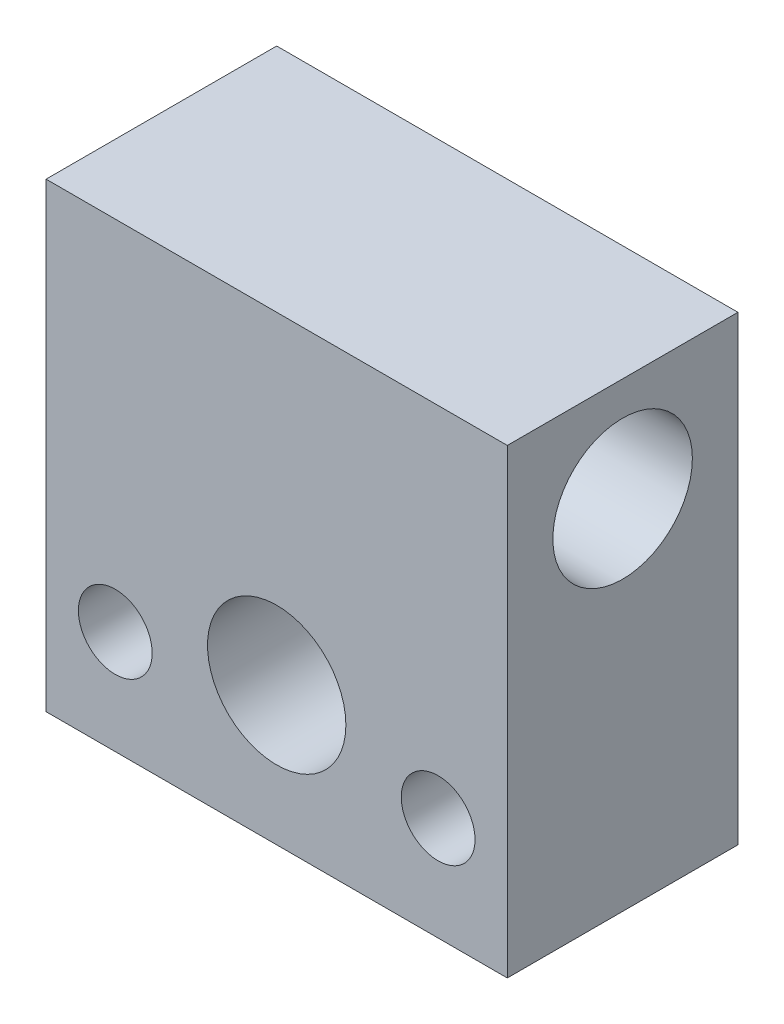
ISO-10303-21;
HEADER;
FILE_DESCRIPTION(('STEP AP214'),'2;1');
FILE_NAME('part.step','',(''),(''),'','','');
FILE_SCHEMA(('AUTOMOTIVE_DESIGN { 1 0 10303 214 1 1 1 1 }'));
ENDSEC;
DATA;
#1=APPLICATION_CONTEXT('core data for automotive mechanical design processes');
#2=APPLICATION_PROTOCOL_DEFINITION('international standard','automotive_design',2000,#1);
#3=PRODUCT_CONTEXT('',#1,'mechanical');
#4=PRODUCT('Part','Part','',(#3));
#5=PRODUCT_RELATED_PRODUCT_CATEGORY('part','',(#4));
#6=PRODUCT_DEFINITION_FORMATION('','',#4);
#7=PRODUCT_DEFINITION_CONTEXT('part definition',#1,'design');
#8=PRODUCT_DEFINITION('design','',#6,#7);
#9=PRODUCT_DEFINITION_SHAPE('','',#8);
#10=(LENGTH_UNIT() NAMED_UNIT(*) SI_UNIT(.MILLI.,.METRE.));
#11=(NAMED_UNIT(*) PLANE_ANGLE_UNIT() SI_UNIT($,.RADIAN.));
#12=(NAMED_UNIT(*) SI_UNIT($,.STERADIAN.) SOLID_ANGLE_UNIT());
#13=UNCERTAINTY_MEASURE_WITH_UNIT(LENGTH_MEASURE(1.E-05),#10,'distance_accuracy_value','');
#14=(GEOMETRIC_REPRESENTATION_CONTEXT(3) GLOBAL_UNCERTAINTY_ASSIGNED_CONTEXT((#13)) GLOBAL_UNIT_ASSIGNED_CONTEXT((#10,
#11,#12)) REPRESENTATION_CONTEXT('',''));
#15=CARTESIAN_POINT('',(0.,0.,0.));
#16=DIRECTION('',(0.,0.,1.));
#17=DIRECTION('',(1.,0.,0.));
#18=AXIS2_PLACEMENT_3D('',#15,#16,#17);
#19=CARTESIAN_POINT('',(-5.,0.,10.));
#20=DIRECTION('',(-1.,0.,0.));
#21=DIRECTION('',(0.,0.,1.));
#22=AXIS2_PLACEMENT_3D('',#19,#20,#21);
#23=PLANE('',#22);
#24=CARTESIAN_POINT('',(-5.,-1.5,2.));
#25=DIRECTION('',(-1.,0.,0.));
#26=DIRECTION('',(0.,0.,1.));
#27=AXIS2_PLACEMENT_3D('',#24,#25,#26);
#28=CIRCLE('',#27,1.);
#29=CARTESIAN_POINT('',(-5.,-1.5,3.));
#30=VERTEX_POINT('',#29);
#31=EDGE_CURVE('E20',#30,#30,#28,.T.);
#32=ORIENTED_EDGE('',*,*,#31,.T.);
#33=EDGE_LOOP('',(#32));
#34=FACE_BOUND('',#33,.T.);
#35=ADVANCED_FACE('F17',(#34),#23,.T.);
#36=CARTESIAN_POINT('',(-6.,0.,0.));
#37=DIRECTION('',(-1.,0.,0.));
#38=DIRECTION('',(0.,0.,1.));
#39=AXIS2_PLACEMENT_3D('',#36,#37,#38);
#40=PLANE('',#39);
#41=CARTESIAN_POINT('',(-6.,-1.5,5.5));
#42=DIRECTION('',(-1.,0.,0.));
#43=DIRECTION('',(0.,0.,1.));
#44=AXIS2_PLACEMENT_3D('',#41,#42,#43);
#45=CIRCLE('',#44,1.5);
#46=CARTESIAN_POINT('',(-6.,-1.5,7.));
#47=VERTEX_POINT('',#46);
#48=EDGE_CURVE('E130',#47,#47,#45,.T.);
#49=ORIENTED_EDGE('',*,*,#48,.T.);
#50=EDGE_LOOP('',(#49));
#51=FACE_BOUND('',#50,.T.);
#52=ADVANCED_FACE('F159',(#51),#40,.T.);
#53=CARTESIAN_POINT('',(0.,5.5,0.));
#54=DIRECTION('',(0.,0.,-1.));
#55=DIRECTION('',(-1.,0.,0.));
#56=AXIS2_PLACEMENT_3D('',#53,#54,#55);
#57=CYLINDRICAL_SURFACE('',#56,1.5);
#58=CARTESIAN_POINT('',(1.5,5.5,1.975));
#59=CARTESIAN_POINT('',(1.49999594047018,5.57900144630801,1.97500356043906));
#60=CARTESIAN_POINT('',(1.49372693576098,5.65804837745387,1.97812566666901));
#61=CARTESIAN_POINT('',(1.46893959830404,5.81376412220572,1.99029966306556));
#62=CARTESIAN_POINT('',(1.45040864995801,5.89043040135985,1.99935766023134));
#63=CARTESIAN_POINT('',(1.40199846961452,6.03896385695773,2.02245479182461));
#64=CARTESIAN_POINT('',(1.37215905632387,6.11084684381869,2.03647643725468));
#65=CARTESIAN_POINT('',(1.30219691790721,6.24849863267949,2.06821357281648));
#66=CARTESIAN_POINT('',(1.26207301806937,6.31426673505646,2.08592948487061));
#67=CARTESIAN_POINT('',(1.16995731065494,6.44222108280155,2.12466073278959));
#68=CARTESIAN_POINT('',(1.11739997976672,6.50395906458766,2.14580990556196));
#69=CARTESIAN_POINT('',(1.0031271487249,6.61815419955558,2.18858021506086));
#70=CARTESIAN_POINT('',(0.941405217206993,6.67060477806009,2.21020167405788));
#71=CARTESIAN_POINT('',(0.804926658722086,6.76873167990099,2.25335964948605));
#72=CARTESIAN_POINT('',(0.729536017881986,6.81359067773629,2.27476493273293));
#73=CARTESIAN_POINT('',(0.571103482437755,6.88980291346821,2.31282681627039));
#74=CARTESIAN_POINT('',(0.4880670033303,6.92116562271595,2.32948674394543));
#75=CARTESIAN_POINT('',(0.321740750954993,6.96747419696827,2.35466323851127));
#76=CARTESIAN_POINT('',(0.238759352163179,6.98328499768358,2.36360494965244));
#77=CARTESIAN_POINT('',(0.0708794694097341,7.00069285570871,2.37347037411611));
#78=CARTESIAN_POINT('',(-0.0140171024281057,7.00230351116717,2.3744017581574));
#79=CARTESIAN_POINT('',(-0.172629443740668,6.99190046308059,2.36848430022382));
#80=CARTESIAN_POINT('',(-0.246490058966555,6.98146052673182,2.36253400278224));
#81=CARTESIAN_POINT('',(-0.391230964006536,6.94997459930692,2.34509525123016));
#82=CARTESIAN_POINT('',(-0.46211032721989,6.92892533676304,2.33360508890698));
#83=CARTESIAN_POINT('',(-0.600898386504531,6.87642947527521,2.30612583887848));
#84=CARTESIAN_POINT('',(-0.668699211124015,6.84475178294496,2.29003805345798));
#85=CARTESIAN_POINT('',(-0.798344551502015,6.77207503652154,2.25517346346266));
#86=CARTESIAN_POINT('',(-0.860186510561525,6.73107200644798,2.23639551316821));
#87=CARTESIAN_POINT('',(-0.984256578247225,6.63496133604325,2.19544298686002));
#88=CARTESIAN_POINT('',(-1.04557656112961,6.57873384380673,2.17313639274875));
#89=CARTESIAN_POINT('',(-1.15830345819555,6.45668082223522,2.12953202590372));
#90=CARTESIAN_POINT('',(-1.20970387570264,6.3908490519359,2.10823492116113));
#91=CARTESIAN_POINT('',(-1.30330651599731,6.24768473858028,2.067873118354));
#92=CARTESIAN_POINT('',(-1.34498421172647,6.16996535849951,2.04895396414971));
#93=CARTESIAN_POINT('',(-1.41428907876496,6.00749420403244,2.01673148934985));
#94=CARTESIAN_POINT('',(-1.44194305133928,5.92275620668402,2.00341746491714));
#95=CARTESIAN_POINT('',(-1.47450721867071,5.78107868035783,1.98757839526593));
#96=CARTESIAN_POINT('',(-1.48404343221979,5.7254041139936,1.98288549806455));
#97=CARTESIAN_POINT('',(-1.49679098596232,5.61316075670564,1.97659516756892));
#98=CARTESIAN_POINT('',(-1.50000290801143,5.55659204852868,1.97499744950821));
#99=CARTESIAN_POINT('',(-1.49999594047018,5.42099855369198,1.97500356043906));
#100=CARTESIAN_POINT('',(-1.49372693576097,5.34195162254613,1.97812566666901));
#101=CARTESIAN_POINT('',(-1.46893959830404,5.18623587779428,1.99029966306556));
#102=CARTESIAN_POINT('',(-1.45040864995801,5.10956959864015,1.99935766023134));
#103=CARTESIAN_POINT('',(-1.40199846961452,4.96103614304227,2.02245479182461));
#104=CARTESIAN_POINT('',(-1.37215905632387,4.88915315618131,2.03647643725468));
#105=CARTESIAN_POINT('',(-1.30219691790721,4.75150136732051,2.06821357281648));
#106=CARTESIAN_POINT('',(-1.26207301806937,4.68573326494354,2.08592948487061));
#107=CARTESIAN_POINT('',(-1.16995731065493,4.55777891719845,2.12466073278959));
#108=CARTESIAN_POINT('',(-1.11739997976672,4.49604093541234,2.14580990556196));
#109=CARTESIAN_POINT('',(-1.0031271487249,4.38184580044442,2.18858021506086));
#110=CARTESIAN_POINT('',(-0.941405217206992,4.32939522193991,2.21020167405788));
#111=CARTESIAN_POINT('',(-0.804926658722085,4.23126832009901,2.25335964948605));
#112=CARTESIAN_POINT('',(-0.729536017881984,4.18640932226371,2.27476493273293));
#113=CARTESIAN_POINT('',(-0.571103482437753,4.11019708653179,2.31282681627039));
#114=CARTESIAN_POINT('',(-0.488067003330298,4.07883437728405,2.32948674394543));
#115=CARTESIAN_POINT('',(-0.321740750954991,4.03252580303173,2.35466323851127));
#116=CARTESIAN_POINT('',(-0.238759352163177,4.01671500231642,2.36360494965244));
#117=CARTESIAN_POINT('',(-0.070879469409732,3.99930714429129,2.37347037411611));
#118=CARTESIAN_POINT('',(0.0140171024281078,3.99769648883283,2.3744017581574));
#119=CARTESIAN_POINT('',(0.17262944374067,4.00809953691941,2.36848430022382));
#120=CARTESIAN_POINT('',(0.246490058966557,4.01853947326818,2.36253400278224));
#121=CARTESIAN_POINT('',(0.391230964006538,4.05002540069308,2.34509525123016));
#122=CARTESIAN_POINT('',(0.462110327219892,4.07107466323696,2.33360508890698));
#123=CARTESIAN_POINT('',(0.600898386504532,4.12357052472479,2.30612583887848));
#124=CARTESIAN_POINT('',(0.668699211124016,4.15524821705504,2.29003805345798));
#125=CARTESIAN_POINT('',(0.798344551502016,4.22792496347846,2.25517346346266));
#126=CARTESIAN_POINT('',(0.860186510561526,4.26892799355202,2.23639551316821));
#127=CARTESIAN_POINT('',(0.984256578247227,4.36503866395675,2.19544298686002));
#128=CARTESIAN_POINT('',(1.04557656112961,4.42126615619327,2.17313639274875));
#129=CARTESIAN_POINT('',(1.15830345819555,4.54331917776478,2.12953202590372));
#130=CARTESIAN_POINT('',(1.20970387570264,4.6091509480641,2.10823492116113));
#131=CARTESIAN_POINT('',(1.30330651599732,4.75231526141973,2.067873118354));
#132=CARTESIAN_POINT('',(1.34498421172647,4.83003464150049,2.04895396414971));
#133=CARTESIAN_POINT('',(1.41428907876496,4.99250579596756,2.01673148934985));
#134=CARTESIAN_POINT('',(1.44194305133928,5.07724379331598,2.00341746491714));
#135=CARTESIAN_POINT('',(1.47450721867071,5.21892131964217,1.98757839526593));
#136=CARTESIAN_POINT('',(1.48404343221979,5.2745958860064,1.98288549806455));
#137=CARTESIAN_POINT('',(1.49679098596232,5.38683924329436,1.97659516756892));
#138=CARTESIAN_POINT('',(1.50000290801143,5.44340795147132,1.97499744950821));
#139=CARTESIAN_POINT('',(1.5,5.5,1.975));
#140=B_SPLINE_CURVE_WITH_KNOTS('',3,(#58,#59,#60,#61,#62,#63,#64,#65,#66,#67,#68,#69,#70,#71,
#72,#73,#74,#75,#76,#77,#78,#79,#80,#81,#82,#83,#84,#85,#86,#87,#88,#89,#90,#91,#92,#93,#94,#95,
#96,#97,#98,#99,#100,#101,#102,#103,#104,#105,#106,#107,#108,#109,#110,#111,#112,#113,#114,#115,
#116,#117,#118,#119,#120,#121,#122,#123,#124,#125,#126,#127,#128,#129,#130,#131,#132,#133,#134,
#135,#136,#137,#138,#139),.UNSPECIFIED.,.T.,.F.,(4,2,2,2,2,2,2,2,2,2,2,2,2,2,2,2,2,2,2,2,2,2,2,
2,2,2,2,2,2,2,2,2,2,2,2,2,2,2,2,2,4),(0.,0.236782321681719,0.473808634445435,0.710007983763761,
0.946234324211956,1.1965638581735,1.44706990138711,1.71660637764891,1.98595339038829,
2.23929197683291,2.49238793826836,2.71583794222608,2.93935689091262,3.16809007155546,
3.39692095903474,3.65420522783989,3.91165743363485,4.18081624560758,4.44945870091991,
4.61909141374399,4.78870851907015,5.02549084075187,5.26251715351558,5.49871650283391,
5.7349428432821,5.98527237724365,6.23577842045725,6.50531489671906,6.77466190945843,
7.02800049590306,7.28109645733851,7.50454646129622,7.72806540998277,7.9567985906256,
8.18562947810489,8.44291374691004,8.700365952705,8.96952476467773,9.23816721999005,
9.40779993281413,9.57741703814029),.UNSPECIFIED.);
#141=CARTESIAN_POINT('',(1.5,5.5,1.975));
#142=VERTEX_POINT('',#141);
#143=EDGE_CURVE('E124',#142,#142,#140,.T.);
#144=ORIENTED_EDGE('',*,*,#143,.T.);
#145=EDGE_LOOP('',(#144));
#146=FACE_BOUND('',#145,.T.);
#147=CARTESIAN_POINT('',(0.,5.5,0.));
#148=DIRECTION('',(0.,0.,-1.));
#149=DIRECTION('',(-1.,0.,0.));
#150=AXIS2_PLACEMENT_3D('',#147,#148,#149);
#151=CIRCLE('',#150,1.5);
#152=CARTESIAN_POINT('',(-1.5,5.5,0.));
#153=VERTEX_POINT('',#152);
#154=EDGE_CURVE('E121',#153,#153,#151,.T.);
#155=ORIENTED_EDGE('',*,*,#154,.T.);
#156=EDGE_LOOP('',(#155));
#157=FACE_BOUND('',#156,.T.);
#158=ADVANCED_FACE('F131',(#146,#157),#57,.F.);
#159=CARTESIAN_POINT('',(-7.,-5.5,5.6843418860808E-11));
#160=DIRECTION('',(0.,0.,-1.));
#161=DIRECTION('',(-1.,0.,0.));
#162=AXIS2_PLACEMENT_3D('',#159,#160,#161);
#163=CONICAL_SURFACE('',#162,2.80000000009795,0.785398163397448);
#164=CARTESIAN_POINT('',(-7.,-5.5,1.2));
#165=DIRECTION('',(0.,0.,1.));
#166=DIRECTION('',(1.,0.,0.));
#167=AXIS2_PLACEMENT_3D('',#164,#165,#166);
#168=CIRCLE('',#167,1.6);
#169=CARTESIAN_POINT('',(-5.4,-5.5,1.2));
#170=VERTEX_POINT('',#169);
#171=EDGE_CURVE('E93',#170,#170,#168,.T.);
#172=ORIENTED_EDGE('',*,*,#171,.T.);
#173=EDGE_LOOP('',(#172));
#174=FACE_BOUND('',#173,.T.);
#175=CARTESIAN_POINT('',(-7.,-5.5,5.6843418860808E-11));
#176=DIRECTION('',(0.,0.,-1.));
#177=DIRECTION('',(-1.,0.,0.));
#178=AXIS2_PLACEMENT_3D('',#175,#176,#177);
#179=CIRCLE('',#178,2.80000000009795);
#180=CARTESIAN_POINT('',(-9.80000000009795,-5.5,5.6843418860808E-11));
#181=VERTEX_POINT('',#180);
#182=EDGE_CURVE('E96',#181,#181,#179,.T.);
#183=ORIENTED_EDGE('',*,*,#182,.T.);
#184=EDGE_LOOP('',(#183));
#185=FACE_BOUND('',#184,.T.);
#186=ADVANCED_FACE('F151',(#174,#185),#163,.F.);
#187=CARTESIAN_POINT('',(7.,-5.5,5.6843418860808E-11));
#188=DIRECTION('',(0.,0.,-1.));
#189=DIRECTION('',(-1.,0.,0.));
#190=AXIS2_PLACEMENT_3D('',#187,#188,#189);
#191=CONICAL_SURFACE('',#190,2.80000000008795,0.785398163397448);
#192=CARTESIAN_POINT('',(7.,-5.5,1.2));
#193=DIRECTION('',(0.,0.,1.));
#194=DIRECTION('',(1.,0.,0.));
#195=AXIS2_PLACEMENT_3D('',#192,#193,#194);
#196=CIRCLE('',#195,1.6);
#197=CARTESIAN_POINT('',(8.6,-5.5,1.2));
#198=VERTEX_POINT('',#197);
#199=EDGE_CURVE('E90',#198,#198,#196,.T.);
#200=ORIENTED_EDGE('',*,*,#199,.T.);
#201=EDGE_LOOP('',(#200));
#202=FACE_BOUND('',#201,.T.);
#203=CARTESIAN_POINT('',(7.,-5.5,5.6843418860808E-11));
#204=DIRECTION('',(0.,0.,-1.));
#205=DIRECTION('',(-1.,0.,0.));
#206=AXIS2_PLACEMENT_3D('',#203,#204,#205);
#207=CIRCLE('',#206,2.80000000008795);
#208=CARTESIAN_POINT('',(4.19999999991205,-5.5,5.6843418860808E-11));
#209=VERTEX_POINT('',#208);
#210=EDGE_CURVE('E118',#209,#209,#207,.T.);
#211=ORIENTED_EDGE('',*,*,#210,.T.);
#212=EDGE_LOOP('',(#211));
#213=FACE_BOUND('',#212,.T.);
#214=ADVANCED_FACE('F148',(#202,#213),#191,.F.);
#215=CARTESIAN_POINT('',(-10.,-1.5,2.));
#216=DIRECTION('',(-1.,0.,0.));
#217=DIRECTION('',(0.,0.,1.));
#218=AXIS2_PLACEMENT_3D('',#215,#216,#217);
#219=CYLINDRICAL_SURFACE('',#218,1.);
#220=ORIENTED_EDGE('',*,*,#31,.F.);
#221=EDGE_LOOP('',(#220));
#222=FACE_BOUND('',#221,.T.);
#223=CARTESIAN_POINT('',(-10.,-1.5,2.));
#224=DIRECTION('',(-1.,0.,0.));
#225=DIRECTION('',(0.,0.,1.));
#226=AXIS2_PLACEMENT_3D('',#223,#224,#225);
#227=CIRCLE('',#226,1.);
#228=CARTESIAN_POINT('',(-10.,-1.5,3.));
#229=VERTEX_POINT('',#228);
#230=EDGE_CURVE('E69',#229,#229,#227,.F.);
#231=ORIENTED_EDGE('',*,*,#230,.F.);
#232=EDGE_LOOP('',(#231));
#233=FACE_BOUND('',#232,.T.);
#234=ADVANCED_FACE('F144',(#222,#233),#219,.F.);
#235=CARTESIAN_POINT('',(-10.,-1.5,5.5));
#236=DIRECTION('',(-1.,0.,0.));
#237=DIRECTION('',(0.,0.,1.));
#238=AXIS2_PLACEMENT_3D('',#235,#236,#237);
#239=CYLINDRICAL_SURFACE('',#238,1.5);
#240=ORIENTED_EDGE('',*,*,#48,.F.);
#241=EDGE_LOOP('',(#240));
#242=FACE_BOUND('',#241,.T.);
#243=CARTESIAN_POINT('',(-10.,-1.5,5.5));
#244=DIRECTION('',(-1.,0.,0.));
#245=DIRECTION('',(0.,0.,1.));
#246=AXIS2_PLACEMENT_3D('',#243,#244,#245);
#247=CIRCLE('',#246,1.5);
#248=CARTESIAN_POINT('',(-10.,-1.5,7.));
#249=VERTEX_POINT('',#248);
#250=EDGE_CURVE('E86',#249,#249,#247,.F.);
#251=ORIENTED_EDGE('',*,*,#250,.F.);
#252=EDGE_LOOP('',(#251));
#253=FACE_BOUND('',#252,.T.);
#254=ADVANCED_FACE('F139',(#242,#253),#239,.F.);
#255=CARTESIAN_POINT('',(10.,5.5,5.));
#256=DIRECTION('',(1.,0.,0.));
#257=DIRECTION('',(0.,0.,-1.));
#258=AXIS2_PLACEMENT_3D('',#255,#256,#257);
#259=CYLINDRICAL_SURFACE('',#258,3.025);
#260=ORIENTED_EDGE('',*,*,#143,.F.);
#261=EDGE_LOOP('',(#260));
#262=FACE_BOUND('',#261,.T.);
#263=CARTESIAN_POINT('',(-10.,5.5,5.));
#264=DIRECTION('',(1.,0.,0.));
#265=DIRECTION('',(0.,0.,-1.));
#266=AXIS2_PLACEMENT_3D('',#263,#264,#265);
#267=CIRCLE('',#266,3.025);
#268=CARTESIAN_POINT('',(-10.,5.5,1.975));
#269=VERTEX_POINT('',#268);
#270=EDGE_CURVE('E83',#269,#269,#267,.T.);
#271=ORIENTED_EDGE('',*,*,#270,.F.);
#272=EDGE_LOOP('',(#271));
#273=FACE_BOUND('',#272,.T.);
#274=CARTESIAN_POINT('',(10.,5.5,5.));
#275=DIRECTION('',(1.,0.,0.));
#276=DIRECTION('',(0.,0.,-1.));
#277=AXIS2_PLACEMENT_3D('',#274,#275,#276);
#278=CIRCLE('',#277,3.025);
#279=CARTESIAN_POINT('',(10.,5.5,1.975));
#280=VERTEX_POINT('',#279);
#281=EDGE_CURVE('E107',#280,#280,#278,.F.);
#282=ORIENTED_EDGE('',*,*,#281,.F.);
#283=EDGE_LOOP('',(#282));
#284=FACE_BOUND('',#283,.T.);
#285=ADVANCED_FACE('F134',(#262,#273,#284),#259,.F.);
#286=CARTESIAN_POINT('',(0.,0.,0.));
#287=DIRECTION('',(0.,0.,1.));
#288=DIRECTION('',(1.,0.,0.));
#289=AXIS2_PLACEMENT_3D('',#286,#287,#288);
#290=PLANE('',#289);
#291=DIRECTION('',(1.,0.,0.));
#292=VECTOR('',#291,1.);
#293=CARTESIAN_POINT('',(-10.,-10.,0.));
#294=LINE('',#293,#292);
#295=CARTESIAN_POINT('',(-10.,-10.,0.));
#296=VERTEX_POINT('',#295);
#297=CARTESIAN_POINT('',(10.,-10.,0.));
#298=VERTEX_POINT('',#297);
#299=EDGE_CURVE('E74',#296,#298,#294,.T.);
#300=ORIENTED_EDGE('',*,*,#299,.F.);
#301=DIRECTION('',(0.,1.,0.));
#302=VECTOR('',#301,1.);
#303=CARTESIAN_POINT('',(-10.,10.,0.));
#304=LINE('',#303,#302);
#305=CARTESIAN_POINT('',(-10.,10.,0.));
#306=VERTEX_POINT('',#305);
#307=EDGE_CURVE('E55',#306,#296,#304,.F.);
#308=ORIENTED_EDGE('',*,*,#307,.F.);
#309=DIRECTION('',(1.,0.,0.));
#310=VECTOR('',#309,1.);
#311=CARTESIAN_POINT('',(10.,10.,0.));
#312=LINE('',#311,#310);
#313=CARTESIAN_POINT('',(10.,10.,0.));
#314=VERTEX_POINT('',#313);
#315=EDGE_CURVE('E60',#314,#306,#312,.F.);
#316=ORIENTED_EDGE('',*,*,#315,.F.);
#317=DIRECTION('',(0.,1.,0.));
#318=VECTOR('',#317,1.);
#319=CARTESIAN_POINT('',(10.,-10.,0.));
#320=LINE('',#319,#318);
#321=EDGE_CURVE('E339',#298,#314,#320,.T.);
#322=ORIENTED_EDGE('',*,*,#321,.F.);
#323=EDGE_LOOP('',(#300,#308,#316,#322));
#324=FACE_BOUND('',#323,.T.);
#325=CARTESIAN_POINT('',(0.,-4.,0.));
#326=DIRECTION('',(0.,0.,1.));
#327=DIRECTION('',(1.,0.,0.));
#328=AXIS2_PLACEMENT_3D('',#325,#326,#327);
#329=CIRCLE('',#328,3.);
#330=CARTESIAN_POINT('',(3.,-4.,0.));
#331=VERTEX_POINT('',#330);
#332=EDGE_CURVE('E70',#331,#331,#329,.T.);
#333=ORIENTED_EDGE('',*,*,#332,.T.);
#334=EDGE_LOOP('',(#333));
#335=FACE_BOUND('',#334,.T.);
#336=ORIENTED_EDGE('',*,*,#182,.F.);
#337=EDGE_LOOP('',(#336));
#338=FACE_BOUND('',#337,.T.);
#339=ORIENTED_EDGE('',*,*,#210,.F.);
#340=EDGE_LOOP('',(#339));
#341=FACE_BOUND('',#340,.T.);
#342=ORIENTED_EDGE('',*,*,#154,.F.);
#343=EDGE_LOOP('',(#342));
#344=FACE_BOUND('',#343,.T.);
#345=ADVANCED_FACE('F72',(#324,#335,#338,#341,#344),#290,.F.);
#346=CARTESIAN_POINT('',(-7.,-5.5,10.));
#347=DIRECTION('',(0.,0.,1.));
#348=DIRECTION('',(1.,0.,0.));
#349=AXIS2_PLACEMENT_3D('',#346,#347,#348);
#350=CYLINDRICAL_SURFACE('',#349,1.6);
#351=ORIENTED_EDGE('',*,*,#171,.F.);
#352=EDGE_LOOP('',(#351));
#353=FACE_BOUND('',#352,.T.);
#354=CARTESIAN_POINT('',(-7.,-5.5,10.));
#355=DIRECTION('',(0.,0.,1.));
#356=DIRECTION('',(1.,0.,0.));
#357=AXIS2_PLACEMENT_3D('',#354,#355,#356);
#358=CIRCLE('',#357,1.6);
#359=CARTESIAN_POINT('',(-5.4,-5.5,10.));
#360=VERTEX_POINT('',#359);
#361=EDGE_CURVE('E104',#360,#360,#358,.F.);
#362=ORIENTED_EDGE('',*,*,#361,.F.);
#363=EDGE_LOOP('',(#362));
#364=FACE_BOUND('',#363,.T.);
#365=ADVANCED_FACE('F188',(#353,#364),#350,.F.);
#366=CARTESIAN_POINT('',(7.,-5.5,10.));
#367=DIRECTION('',(0.,0.,1.));
#368=DIRECTION('',(1.,0.,0.));
#369=AXIS2_PLACEMENT_3D('',#366,#367,#368);
#370=CYLINDRICAL_SURFACE('',#369,1.6);
#371=ORIENTED_EDGE('',*,*,#199,.F.);
#372=EDGE_LOOP('',(#371));
#373=FACE_BOUND('',#372,.T.);
#374=CARTESIAN_POINT('',(7.,-5.5,10.));
#375=DIRECTION('',(0.,0.,1.));
#376=DIRECTION('',(1.,0.,0.));
#377=AXIS2_PLACEMENT_3D('',#374,#375,#376);
#378=CIRCLE('',#377,1.6);
#379=CARTESIAN_POINT('',(8.6,-5.5,10.));
#380=VERTEX_POINT('',#379);
#381=EDGE_CURVE('E101',#380,#380,#378,.F.);
#382=ORIENTED_EDGE('',*,*,#381,.F.);
#383=EDGE_LOOP('',(#382));
#384=FACE_BOUND('',#383,.T.);
#385=ADVANCED_FACE('F185',(#373,#384),#370,.F.);
#386=CARTESIAN_POINT('',(0.,-4.,10.));
#387=DIRECTION('',(0.,0.,1.));
#388=DIRECTION('',(1.,0.,0.));
#389=AXIS2_PLACEMENT_3D('',#386,#387,#388);
#390=CYLINDRICAL_SURFACE('',#389,3.);
#391=ORIENTED_EDGE('',*,*,#332,.F.);
#392=EDGE_LOOP('',(#391));
#393=FACE_BOUND('',#392,.T.);
#394=CARTESIAN_POINT('',(0.,-4.,10.));
#395=DIRECTION('',(0.,0.,1.));
#396=DIRECTION('',(1.,0.,0.));
#397=AXIS2_PLACEMENT_3D('',#394,#395,#396);
#398=CIRCLE('',#397,3.);
#399=CARTESIAN_POINT('',(3.,-4.,10.));
#400=VERTEX_POINT('',#399);
#401=EDGE_CURVE('E97',#400,#400,#398,.F.);
#402=ORIENTED_EDGE('',*,*,#401,.F.);
#403=EDGE_LOOP('',(#402));
#404=FACE_BOUND('',#403,.T.);
#405=ADVANCED_FACE('F182',(#393,#404),#390,.F.);
#406=CARTESIAN_POINT('',(10.,10.,0.));
#407=DIRECTION('',(0.,1.,0.));
#408=DIRECTION('',(0.,0.,1.));
#409=AXIS2_PLACEMENT_3D('',#406,#407,#408);
#410=PLANE('',#409);
#411=DIRECTION('',(0.,0.,1.));
#412=VECTOR('',#411,1.);
#413=CARTESIAN_POINT('',(-10.,10.,0.));
#414=LINE('',#413,#412);
#415=CARTESIAN_POINT('',(-10.,10.,10.));
#416=VERTEX_POINT('',#415);
#417=EDGE_CURVE('E62',#416,#306,#414,.F.);
#418=ORIENTED_EDGE('',*,*,#417,.F.);
#419=DIRECTION('',(1.,0.,0.));
#420=VECTOR('',#419,1.);
#421=CARTESIAN_POINT('',(0.,10.,10.));
#422=LINE('',#421,#420);
#423=CARTESIAN_POINT('',(10.,10.,10.));
#424=VERTEX_POINT('',#423);
#425=EDGE_CURVE('E100',#424,#416,#422,.F.);
#426=ORIENTED_EDGE('',*,*,#425,.F.);
#427=DIRECTION('',(0.,0.,-1.));
#428=VECTOR('',#427,1.);
#429=CARTESIAN_POINT('',(10.,10.,0.));
#430=LINE('',#429,#428);
#431=EDGE_CURVE('E65',#314,#424,#430,.F.);
#432=ORIENTED_EDGE('',*,*,#431,.F.);
#433=ORIENTED_EDGE('',*,*,#315,.T.);
#434=EDGE_LOOP('',(#418,#426,#432,#433));
#435=FACE_BOUND('',#434,.T.);
#436=ADVANCED_FACE('F61',(#435),#410,.T.);
#437=CARTESIAN_POINT('',(-10.,10.,0.));
#438=DIRECTION('',(-1.,0.,0.));
#439=DIRECTION('',(0.,0.,1.));
#440=AXIS2_PLACEMENT_3D('',#437,#438,#439);
#441=PLANE('',#440);
#442=DIRECTION('',(0.,0.,-1.));
#443=VECTOR('',#442,1.);
#444=CARTESIAN_POINT('',(-10.,-10.,0.));
#445=LINE('',#444,#443);
#446=CARTESIAN_POINT('',(-10.,-10.,10.));
#447=VERTEX_POINT('',#446);
#448=EDGE_CURVE('E76',#447,#296,#445,.T.);
#449=ORIENTED_EDGE('',*,*,#448,.F.);
#450=DIRECTION('',(0.,1.,0.));
#451=VECTOR('',#450,1.);
#452=CARTESIAN_POINT('',(-10.,0.,10.));
#453=LINE('',#452,#451);
#454=EDGE_CURVE('E81',#416,#447,#453,.F.);
#455=ORIENTED_EDGE('',*,*,#454,.F.);
#456=ORIENTED_EDGE('',*,*,#417,.T.);
#457=ORIENTED_EDGE('',*,*,#307,.T.);
#458=EDGE_LOOP('',(#449,#455,#456,#457));
#459=FACE_BOUND('',#458,.T.);
#460=ORIENTED_EDGE('',*,*,#270,.T.);
#461=EDGE_LOOP('',(#460));
#462=FACE_BOUND('',#461,.T.);
#463=ORIENTED_EDGE('',*,*,#250,.T.);
#464=EDGE_LOOP('',(#463));
#465=FACE_BOUND('',#464,.T.);
#466=ORIENTED_EDGE('',*,*,#230,.T.);
#467=EDGE_LOOP('',(#466));
#468=FACE_BOUND('',#467,.T.);
#469=ADVANCED_FACE('F78',(#459,#462,#465,#468),#441,.T.);
#470=CARTESIAN_POINT('',(-10.,-10.,0.));
#471=DIRECTION('',(0.,-1.,0.));
#472=DIRECTION('',(0.,0.,-1.));
#473=AXIS2_PLACEMENT_3D('',#470,#471,#472);
#474=PLANE('',#473);
#475=DIRECTION('',(0.,0.,-1.));
#476=VECTOR('',#475,1.);
#477=CARTESIAN_POINT('',(10.,-10.,0.));
#478=LINE('',#477,#476);
#479=CARTESIAN_POINT('',(10.,-10.,10.));
#480=VERTEX_POINT('',#479);
#481=EDGE_CURVE('E35',#480,#298,#478,.T.);
#482=ORIENTED_EDGE('',*,*,#481,.F.);
#483=DIRECTION('',(1.,0.,0.));
#484=VECTOR('',#483,1.);
#485=CARTESIAN_POINT('',(0.,-10.,10.));
#486=LINE('',#485,#484);
#487=EDGE_CURVE('E26',#447,#480,#486,.T.);
#488=ORIENTED_EDGE('',*,*,#487,.F.);
#489=ORIENTED_EDGE('',*,*,#448,.T.);
#490=ORIENTED_EDGE('',*,*,#299,.T.);
#491=EDGE_LOOP('',(#482,#488,#489,#490));
#492=FACE_BOUND('',#491,.T.);
#493=ADVANCED_FACE('F170',(#492),#474,.T.);
#494=CARTESIAN_POINT('',(10.,-10.,0.));
#495=DIRECTION('',(1.,0.,0.));
#496=DIRECTION('',(0.,0.,-1.));
#497=AXIS2_PLACEMENT_3D('',#494,#495,#496);
#498=PLANE('',#497);
#499=ORIENTED_EDGE('',*,*,#431,.T.);
#500=DIRECTION('',(0.,1.,0.));
#501=VECTOR('',#500,1.);
#502=CARTESIAN_POINT('',(10.,0.,10.));
#503=LINE('',#502,#501);
#504=EDGE_CURVE('E10',#480,#424,#503,.T.);
#505=ORIENTED_EDGE('',*,*,#504,.F.);
#506=ORIENTED_EDGE('',*,*,#481,.T.);
#507=ORIENTED_EDGE('',*,*,#321,.T.);
#508=EDGE_LOOP('',(#499,#505,#506,#507));
#509=FACE_BOUND('',#508,.T.);
#510=ORIENTED_EDGE('',*,*,#281,.T.);
#511=EDGE_LOOP('',(#510));
#512=FACE_BOUND('',#511,.T.);
#513=ADVANCED_FACE('F164',(#509,#512),#498,.T.);
#514=CARTESIAN_POINT('',(0.,0.,10.));
#515=DIRECTION('',(0.,0.,1.));
#516=DIRECTION('',(1.,0.,0.));
#517=AXIS2_PLACEMENT_3D('',#514,#515,#516);
#518=PLANE('',#517);
#519=ORIENTED_EDGE('',*,*,#487,.T.);
#520=ORIENTED_EDGE('',*,*,#504,.T.);
#521=ORIENTED_EDGE('',*,*,#425,.T.);
#522=ORIENTED_EDGE('',*,*,#454,.T.);
#523=EDGE_LOOP('',(#519,#520,#521,#522));
#524=FACE_BOUND('',#523,.T.);
#525=ORIENTED_EDGE('',*,*,#401,.T.);
#526=EDGE_LOOP('',(#525));
#527=FACE_BOUND('',#526,.T.);
#528=ORIENTED_EDGE('',*,*,#381,.T.);
#529=EDGE_LOOP('',(#528));
#530=FACE_BOUND('',#529,.T.);
#531=ORIENTED_EDGE('',*,*,#361,.T.);
#532=EDGE_LOOP('',(#531));
#533=FACE_BOUND('',#532,.T.);
#534=ADVANCED_FACE('F162',(#524,#527,#530,#533),#518,.T.);
#535=CLOSED_SHELL('',(#35,#52,#158,#186,#214,#234,#254,#285,#345,#365,#385,#405,#436,#469,#493,
#513,#534));
#536=MANIFOLD_SOLID_BREP('B1',#535);
#537=ADVANCED_BREP_SHAPE_REPRESENTATION('',(#18,#536),#14);
#538=SHAPE_DEFINITION_REPRESENTATION(#9,#537);
ENDSEC;
END-ISO-10303-21;
